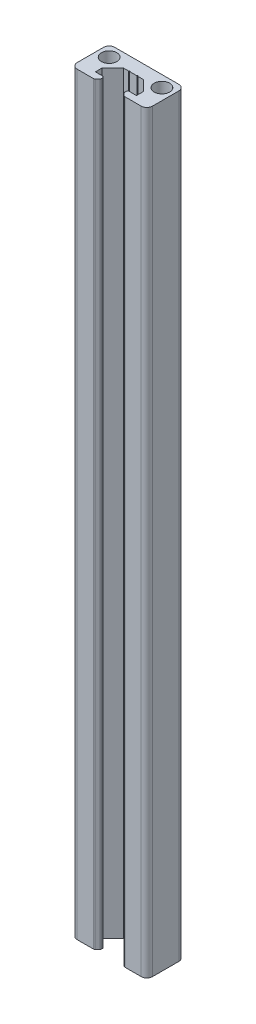
ISO-10303-21;
HEADER;
FILE_DESCRIPTION(('STEP AP214'),'2;1');
FILE_NAME('part.step','',(''),(''),'','','');
FILE_SCHEMA(('AUTOMOTIVE_DESIGN { 1 0 10303 214 1 1 1 1 }'));
ENDSEC;
DATA;
#1=APPLICATION_CONTEXT('core data for automotive mechanical design processes');
#2=APPLICATION_PROTOCOL_DEFINITION('international standard','automotive_design',2000,#1);
#3=PRODUCT_CONTEXT('',#1,'mechanical');
#4=PRODUCT('Part','Part','',(#3));
#5=PRODUCT_RELATED_PRODUCT_CATEGORY('part','',(#4));
#6=PRODUCT_DEFINITION_FORMATION('','',#4);
#7=PRODUCT_DEFINITION_CONTEXT('part definition',#1,'design');
#8=PRODUCT_DEFINITION('design','',#6,#7);
#9=PRODUCT_DEFINITION_SHAPE('','',#8);
#10=(LENGTH_UNIT() NAMED_UNIT(*) SI_UNIT(.MILLI.,.METRE.));
#11=(NAMED_UNIT(*) PLANE_ANGLE_UNIT() SI_UNIT($,.RADIAN.));
#12=(NAMED_UNIT(*) SI_UNIT($,.STERADIAN.) SOLID_ANGLE_UNIT());
#13=UNCERTAINTY_MEASURE_WITH_UNIT(LENGTH_MEASURE(1.E-05),#10,'distance_accuracy_value','');
#14=(GEOMETRIC_REPRESENTATION_CONTEXT(3) GLOBAL_UNCERTAINTY_ASSIGNED_CONTEXT((#13)) GLOBAL_UNIT_ASSIGNED_CONTEXT((#10,
#11,#12)) REPRESENTATION_CONTEXT('',''));
#15=CARTESIAN_POINT('',(0.,0.,0.));
#16=DIRECTION('',(0.,0.,1.));
#17=DIRECTION('',(1.,0.,0.));
#18=AXIS2_PLACEMENT_3D('',#15,#16,#17);
#19=CARTESIAN_POINT('',(-7.87459328292926,0.,-0.341605811527471));
#20=DIRECTION('',(0.,1.,0.));
#21=DIRECTION('',(1.,0.,0.));
#22=AXIS2_PLACEMENT_3D('',#19,#20,#21);
#23=PLANE('',#22);
#24=CARTESIAN_POINT('',(-0.874593282930221,0.,-2.34160581152736));
#25=DIRECTION('',(0.,-1.,0.));
#26=DIRECTION('',(-1.,0.,0.));
#27=AXIS2_PLACEMENT_3D('',#24,#25,#26);
#28=CIRCLE('',#27,2.05000000000013);
#29=CARTESIAN_POINT('',(1.1754067170699,0.,-2.34160581152736));
#30=VERTEX_POINT('',#29);
#31=EDGE_CURVE('E334',#30,#30,#28,.T.);
#32=ORIENTED_EDGE('',*,*,#31,.F.);
#33=EDGE_LOOP('',(#32));
#34=FACE_BOUND('',#33,.T.);
#35=CARTESIAN_POINT('',(-14.8745932829294,0.,-2.34160581152736));
#36=DIRECTION('',(0.,-1.,0.));
#37=DIRECTION('',(-1.,0.,0.));
#38=AXIS2_PLACEMENT_3D('',#35,#36,#37);
#39=CIRCLE('',#38,2.05000000000013);
#40=CARTESIAN_POINT('',(-12.8245932829293,0.,-2.34160581152736));
#41=VERTEX_POINT('',#40);
#42=EDGE_CURVE('E333',#41,#41,#39,.T.);
#43=ORIENTED_EDGE('',*,*,#42,.F.);
#44=EDGE_LOOP('',(#43));
#45=FACE_BOUND('',#44,.T.);
#46=CARTESIAN_POINT('',(-11.4745932829294,0.,3.55128740728645));
#47=DIRECTION('',(0.,1.,0.));
#48=DIRECTION('',(0.707106781186548,0.,0.707106781186547));
#49=AXIS2_PLACEMENT_3D('',#46,#47,#48);
#50=CIRCLE('',#49,0.499999999999924);
#51=CARTESIAN_POINT('',(-11.1210398923362,0.,3.90484079787967));
#52=VERTEX_POINT('',#51);
#53=CARTESIAN_POINT('',(-10.9745932829293,0.,3.55128740728645));
#54=VERTEX_POINT('',#53);
#55=EDGE_CURVE('E11',#52,#54,#50,.T.);
#56=ORIENTED_EDGE('',*,*,#55,.F.);
#57=DIRECTION('',(-0.707106781187044,0.,0.707106781186051));
#58=VECTOR('',#57,1.);
#59=CARTESIAN_POINT('',(-11.1210398923362,0.,3.90484079787967));
#60=LINE('',#59,#58);
#61=CARTESIAN_POINT('',(-11.7281466735233,0.,4.51194757906592));
#62=VERTEX_POINT('',#61);
#63=EDGE_CURVE('E468',#52,#62,#60,.T.);
#64=ORIENTED_EDGE('',*,*,#63,.T.);
#65=CARTESIAN_POINT('',(-12.0817000641165,0.,4.1583941884727));
#66=DIRECTION('',(0.,1.,0.));
#67=DIRECTION('',(0.,0.,1.));
#68=AXIS2_PLACEMENT_3D('',#65,#66,#67);
#69=CIRCLE('',#68,0.500000000000114);
#70=CARTESIAN_POINT('',(-12.0817000641165,0.,4.65839418847281));
#71=VERTEX_POINT('',#70);
#72=EDGE_CURVE('E524',#71,#62,#69,.T.);
#73=ORIENTED_EDGE('',*,*,#72,.F.);
#74=DIRECTION('',(-1.,0.,0.));
#75=VECTOR('',#74,1.);
#76=CARTESIAN_POINT('',(-12.0817000641165,0.,4.65839418847281));
#77=LINE('',#76,#75);
#78=CARTESIAN_POINT('',(-16.3745932829292,0.,4.65839418847253));
#79=VERTEX_POINT('',#78);
#80=EDGE_CURVE('E505',#71,#79,#77,.T.);
#81=ORIENTED_EDGE('',*,*,#80,.T.);
#82=CARTESIAN_POINT('',(-16.3745932829292,0.,3.15839418847247));
#83=DIRECTION('',(0.,1.,0.));
#84=DIRECTION('',(-1.,0.,0.));
#85=AXIS2_PLACEMENT_3D('',#82,#83,#84);
#86=CIRCLE('',#85,1.50000000000006);
#87=CARTESIAN_POINT('',(-17.8745932829293,0.,3.15839418847247));
#88=VERTEX_POINT('',#87);
#89=EDGE_CURVE('E393',#88,#79,#86,.T.);
#90=ORIENTED_EDGE('',*,*,#89,.F.);
#91=DIRECTION('',(0.,0.,1.));
#92=VECTOR('',#91,1.);
#93=CARTESIAN_POINT('',(-17.8745932829293,0.,-3.84160581152741));
#94=LINE('',#93,#92);
#95=CARTESIAN_POINT('',(-17.8745932829293,0.,-3.84160581152741));
#96=VERTEX_POINT('',#95);
#97=EDGE_CURVE('E450',#96,#88,#94,.T.);
#98=ORIENTED_EDGE('',*,*,#97,.F.);
#99=CARTESIAN_POINT('',(-16.3745932829292,0.,-3.84160581152741));
#100=DIRECTION('',(0.,1.,0.));
#101=DIRECTION('',(0.,0.,-1.));
#102=AXIS2_PLACEMENT_3D('',#99,#100,#101);
#103=CIRCLE('',#102,1.50000000000006);
#104=CARTESIAN_POINT('',(-16.3745932829292,0.,-5.34160581152747));
#105=VERTEX_POINT('',#104);
#106=EDGE_CURVE('E554',#105,#96,#103,.T.);
#107=ORIENTED_EDGE('',*,*,#106,.F.);
#108=DIRECTION('',(-1.,0.,0.));
#109=VECTOR('',#108,1.);
#110=CARTESIAN_POINT('',(0.625406717070688,0.,-5.34160581152747));
#111=LINE('',#110,#109);
#112=CARTESIAN_POINT('',(0.625406717070688,0.,-5.34160581152747));
#113=VERTEX_POINT('',#112);
#114=EDGE_CURVE('E516',#113,#105,#111,.T.);
#115=ORIENTED_EDGE('',*,*,#114,.F.);
#116=CARTESIAN_POINT('',(0.625406717070688,0.,-3.84160581152742));
#117=DIRECTION('',(0.,1.,0.));
#118=DIRECTION('',(1.,0.,0.));
#119=AXIS2_PLACEMENT_3D('',#116,#117,#118);
#120=CIRCLE('',#119,1.50000000000006);
#121=CARTESIAN_POINT('',(2.12540671707074,0.,-3.84160581152742));
#122=VERTEX_POINT('',#121);
#123=EDGE_CURVE('E512',#122,#113,#120,.T.);
#124=ORIENTED_EDGE('',*,*,#123,.F.);
#125=DIRECTION('',(0.,0.,-1.));
#126=VECTOR('',#125,1.);
#127=CARTESIAN_POINT('',(2.12540671707075,0.,3.15839418847247));
#128=LINE('',#127,#126);
#129=CARTESIAN_POINT('',(2.12540671707075,0.,3.15839418847247));
#130=VERTEX_POINT('',#129);
#131=EDGE_CURVE('E427',#130,#122,#128,.T.);
#132=ORIENTED_EDGE('',*,*,#131,.F.);
#133=CARTESIAN_POINT('',(0.625406717070689,0.,3.15839418847247));
#134=DIRECTION('',(0.,1.,0.));
#135=DIRECTION('',(0.,0.,1.));
#136=AXIS2_PLACEMENT_3D('',#133,#134,#135);
#137=CIRCLE('',#136,1.50000000000006);
#138=CARTESIAN_POINT('',(0.625406717070689,0.,4.65839418847253));
#139=VERTEX_POINT('',#138);
#140=EDGE_CURVE('E578',#139,#130,#137,.T.);
#141=ORIENTED_EDGE('',*,*,#140,.F.);
#142=DIRECTION('',(1.,0.,0.));
#143=VECTOR('',#142,1.);
#144=CARTESIAN_POINT('',(-3.66748650174344,0.,4.65839418847253));
#145=LINE('',#144,#143);
#146=CARTESIAN_POINT('',(-3.66748650174344,0.,4.65839418847281));
#147=VERTEX_POINT('',#146);
#148=EDGE_CURVE('E379',#147,#139,#145,.T.);
#149=ORIENTED_EDGE('',*,*,#148,.F.);
#150=CARTESIAN_POINT('',(-3.66748650174344,0.,4.1583941884727));
#151=DIRECTION('',(0.,1.,0.));
#152=DIRECTION('',(-0.707106781186547,0.,0.707106781186548));
#153=AXIS2_PLACEMENT_3D('',#150,#151,#152);
#154=CIRCLE('',#153,0.499999999999924);
#155=CARTESIAN_POINT('',(-4.02103989233666,0.,4.51194757906592));
#156=VERTEX_POINT('',#155);
#157=EDGE_CURVE('E371',#156,#147,#154,.T.);
#158=ORIENTED_EDGE('',*,*,#157,.F.);
#159=DIRECTION('',(0.707106781186879,0.,0.707106781186216));
#160=VECTOR('',#159,1.);
#161=CARTESIAN_POINT('',(-4.62814667352348,0.,3.90484079787967));
#162=LINE('',#161,#160);
#163=CARTESIAN_POINT('',(-4.62814667352348,0.,3.90484079787967));
#164=VERTEX_POINT('',#163);
#165=EDGE_CURVE('E384',#164,#156,#162,.T.);
#166=ORIENTED_EDGE('',*,*,#165,.F.);
#167=CARTESIAN_POINT('',(-4.27459328293026,0.,3.55128740728645));
#168=DIRECTION('',(0.,1.,0.));
#169=DIRECTION('',(-1.,0.,0.));
#170=AXIS2_PLACEMENT_3D('',#167,#168,#169);
#171=CIRCLE('',#170,0.500000000000114);
#172=CARTESIAN_POINT('',(-4.77459328293037,0.,3.55128740728645));
#173=VERTEX_POINT('',#172);
#174=EDGE_CURVE('E408',#173,#164,#171,.T.);
#175=ORIENTED_EDGE('',*,*,#174,.F.);
#176=DIRECTION('',(0.,0.,-1.));
#177=VECTOR('',#176,1.);
#178=CARTESIAN_POINT('',(-4.77459328293037,0.,3.55128740728645));
#179=LINE('',#178,#177);
#180=CARTESIAN_POINT('',(-4.77459328293037,0.,3.35839418847144));
#181=VERTEX_POINT('',#180);
#182=EDGE_CURVE('E433',#173,#181,#179,.T.);
#183=ORIENTED_EDGE('',*,*,#182,.T.);
#184=CARTESIAN_POINT('',(-4.27459328293026,0.,3.35839418847144));
#185=DIRECTION('',(0.,1.,0.));
#186=DIRECTION('',(5.68311723928036E-13,0.,-1.));
#187=AXIS2_PLACEMENT_3D('',#184,#185,#186);
#188=CIRCLE('',#187,0.500000000000114);
#189=CARTESIAN_POINT('',(-4.27459328292997,0.,2.85839418847132));
#190=VERTEX_POINT('',#189);
#191=EDGE_CURVE('E403',#190,#181,#188,.T.);
#192=ORIENTED_EDGE('',*,*,#191,.F.);
#193=DIRECTION('',(-1.,0.,-7.68031844249678E-13));
#194=VECTOR('',#193,1.);
#195=CARTESIAN_POINT('',(-2.42459328292938,0.,2.85839418847274));
#196=LINE('',#195,#194);
#197=CARTESIAN_POINT('',(-2.42459328292938,0.,2.85839418847274));
#198=VERTEX_POINT('',#197);
#199=EDGE_CURVE('E339',#198,#190,#196,.T.);
#200=ORIENTED_EDGE('',*,*,#199,.F.);
#201=DIRECTION('',(0.,0.,-1.));
#202=VECTOR('',#201,1.);
#203=CARTESIAN_POINT('',(-2.42459328292938,0.,2.85839418847274));
#204=LINE('',#203,#202);
#205=CARTESIAN_POINT('',(-2.42459328292938,0.,1.05839418847268));
#206=VERTEX_POINT('',#205);
#207=EDGE_CURVE('E349',#198,#206,#204,.T.);
#208=ORIENTED_EDGE('',*,*,#207,.T.);
#209=DIRECTION('',(0.707106781186548,0.,0.707106781186547));
#210=VECTOR('',#209,1.);
#211=CARTESIAN_POINT('',(-5.22459328292939,0.,-1.74160581152733));
#212=LINE('',#211,#210);
#213=CARTESIAN_POINT('',(-5.22459328292939,0.,-1.74160581152733));
#214=VERTEX_POINT('',#213);
#215=EDGE_CURVE('E323',#214,#206,#212,.T.);
#216=ORIENTED_EDGE('',*,*,#215,.F.);
#217=DIRECTION('',(-1.,0.,0.));
#218=VECTOR('',#217,1.);
#219=CARTESIAN_POINT('',(-5.22459328292939,0.,-1.74160581152733));
#220=LINE('',#219,#218);
#221=CARTESIAN_POINT('',(-6.62459328292954,0.,-1.74160581152733));
#222=VERTEX_POINT('',#221);
#223=EDGE_CURVE('E515',#214,#222,#220,.T.);
#224=ORIENTED_EDGE('',*,*,#223,.T.);
#225=CARTESIAN_POINT('',(-6.7745932829294,0.,-1.74160581152733));
#226=DIRECTION('',(0.,1.,0.));
#227=DIRECTION('',(1.,0.,0.));
#228=AXIS2_PLACEMENT_3D('',#225,#226,#227);
#229=CIRCLE('',#228,0.149999999999864);
#230=CARTESIAN_POINT('',(-6.92459328292927,0.,-1.74160581152733));
#231=VERTEX_POINT('',#230);
#232=EDGE_CURVE('E307',#222,#231,#229,.T.);
#233=ORIENTED_EDGE('',*,*,#232,.T.);
#234=DIRECTION('',(-1.,0.,0.));
#235=VECTOR('',#234,1.);
#236=CARTESIAN_POINT('',(-6.92459328292927,0.,-1.74160581152733));
#237=LINE('',#236,#235);
#238=CARTESIAN_POINT('',(-8.82459328292953,0.,-1.74160581152733));
#239=VERTEX_POINT('',#238);
#240=EDGE_CURVE('E305',#231,#239,#237,.T.);
#241=ORIENTED_EDGE('',*,*,#240,.T.);
#242=CARTESIAN_POINT('',(-8.97459328292939,0.,-1.74160581152733));
#243=DIRECTION('',(0.,1.,0.));
#244=DIRECTION('',(1.,0.,0.));
#245=AXIS2_PLACEMENT_3D('',#242,#243,#244);
#246=CIRCLE('',#245,0.149999999999864);
#247=CARTESIAN_POINT('',(-9.12459328292926,0.,-1.74160581152733));
#248=VERTEX_POINT('',#247);
#249=EDGE_CURVE('E291',#239,#248,#246,.T.);
#250=ORIENTED_EDGE('',*,*,#249,.T.);
#251=DIRECTION('',(-1.,0.,0.));
#252=VECTOR('',#251,1.);
#253=CARTESIAN_POINT('',(-9.12459328292926,0.,-1.74160581152733));
#254=LINE('',#253,#252);
#255=CARTESIAN_POINT('',(-10.5245932829294,0.,-1.74160581152733));
#256=VERTEX_POINT('',#255);
#257=EDGE_CURVE('E388',#248,#256,#254,.T.);
#258=ORIENTED_EDGE('',*,*,#257,.T.);
#259=DIRECTION('',(-0.707106781186547,0.,0.707106781186548));
#260=VECTOR('',#259,1.);
#261=CARTESIAN_POINT('',(-10.5245932829294,0.,-1.74160581152733));
#262=LINE('',#261,#260);
#263=CARTESIAN_POINT('',(-13.3245932829294,0.,1.05839418847268));
#264=VERTEX_POINT('',#263);
#265=EDGE_CURVE('E360',#256,#264,#262,.T.);
#266=ORIENTED_EDGE('',*,*,#265,.T.);
#267=DIRECTION('',(0.,0.,-1.));
#268=VECTOR('',#267,1.);
#269=CARTESIAN_POINT('',(-13.3245932829294,0.,2.85839418847275));
#270=LINE('',#269,#268);
#271=CARTESIAN_POINT('',(-13.3245932829294,0.,2.85839418847275));
#272=VERTEX_POINT('',#271);
#273=EDGE_CURVE('E443',#272,#264,#270,.T.);
#274=ORIENTED_EDGE('',*,*,#273,.F.);
#275=DIRECTION('',(1.,0.,-6.14645911824061E-13));
#276=VECTOR('',#275,1.);
#277=CARTESIAN_POINT('',(-13.3245932829294,0.,2.85839418847275));
#278=LINE('',#277,#276);
#279=CARTESIAN_POINT('',(-11.4745932829302,0.,2.85839418847132));
#280=VERTEX_POINT('',#279);
#281=EDGE_CURVE('E370',#272,#280,#278,.T.);
#282=ORIENTED_EDGE('',*,*,#281,.T.);
#283=CARTESIAN_POINT('',(-11.4745932829294,0.,3.35839418847144));
#284=DIRECTION('',(0.,1.,0.));
#285=DIRECTION('',(1.,0.,0.));
#286=AXIS2_PLACEMENT_3D('',#283,#284,#285);
#287=CIRCLE('',#286,0.500000000000114);
#288=CARTESIAN_POINT('',(-10.9745932829293,0.,3.35839418847144));
#289=VERTEX_POINT('',#288);
#290=EDGE_CURVE('E369',#289,#280,#287,.T.);
#291=ORIENTED_EDGE('',*,*,#290,.F.);
#292=DIRECTION('',(0.,0.,-1.));
#293=VECTOR('',#292,1.);
#294=CARTESIAN_POINT('',(-10.9745932829296,0.,3.55128740728645));
#295=LINE('',#294,#293);
#296=EDGE_CURVE('E28',#54,#289,#295,.T.);
#297=ORIENTED_EDGE('',*,*,#296,.F.);
#298=EDGE_LOOP('',(#56,#64,#73,#81,#90,#98,#107,#115,#124,#132,#141,#149,#158,#166,#175,#183,
#192,#200,#208,#216,#224,#233,#241,#250,#258,#266,#274,#282,#291,#297));
#299=FACE_BOUND('',#298,.T.);
#300=ADVANCED_FACE('F17',(#34,#45,#299),#23,.F.);
#301=CARTESIAN_POINT('',(-11.4745932829294,0.,3.55128740728645));
#302=DIRECTION('',(0.,1.,0.));
#303=DIRECTION('',(0.707106781186548,0.,0.707106781186547));
#304=AXIS2_PLACEMENT_3D('',#301,#302,#303);
#305=CYLINDRICAL_SURFACE('',#304,0.499999999999924);
#306=DIRECTION('',(0.,1.,0.));
#307=VECTOR('',#306,1.);
#308=CARTESIAN_POINT('',(-11.1210398923362,0.,3.90484079787967));
#309=LINE('',#308,#307);
#310=CARTESIAN_POINT('',(-11.1210398923362,200.,3.90484079787967));
#311=VERTEX_POINT('',#310);
#312=EDGE_CURVE('E565',#52,#311,#309,.T.);
#313=ORIENTED_EDGE('',*,*,#312,.F.);
#314=ORIENTED_EDGE('',*,*,#55,.T.);
#315=DIRECTION('',(0.,1.,0.));
#316=VECTOR('',#315,1.);
#317=CARTESIAN_POINT('',(-10.9745932829293,0.,3.55128740728645));
#318=LINE('',#317,#316);
#319=CARTESIAN_POINT('',(-10.9745932829293,200.,3.55128740728645));
#320=VERTEX_POINT('',#319);
#321=EDGE_CURVE('E557',#54,#320,#318,.T.);
#322=ORIENTED_EDGE('',*,*,#321,.T.);
#323=CARTESIAN_POINT('',(-11.4745932829294,200.,3.55128740728645));
#324=DIRECTION('',(0.,1.,0.));
#325=DIRECTION('',(0.707106781186548,0.,0.707106781186547));
#326=AXIS2_PLACEMENT_3D('',#323,#324,#325);
#327=CIRCLE('',#326,0.499999999999924);
#328=EDGE_CURVE('E456',#311,#320,#327,.T.);
#329=ORIENTED_EDGE('',*,*,#328,.F.);
#330=EDGE_LOOP('',(#313,#314,#322,#329));
#331=FACE_BOUND('',#330,.T.);
#332=ADVANCED_FACE('F721',(#331),#305,.T.);
#333=CARTESIAN_POINT('',(-10.9745932829296,0.,3.55128740728645));
#334=DIRECTION('',(1.,0.,0.));
#335=DIRECTION('',(0.,0.,-1.));
#336=AXIS2_PLACEMENT_3D('',#333,#334,#335);
#337=PLANE('',#336);
#338=ORIENTED_EDGE('',*,*,#321,.F.);
#339=ORIENTED_EDGE('',*,*,#296,.T.);
#340=DIRECTION('',(0.,1.,0.));
#341=VECTOR('',#340,1.);
#342=CARTESIAN_POINT('',(-10.9745932829293,0.,3.35839418847144));
#343=LINE('',#342,#341);
#344=CARTESIAN_POINT('',(-10.9745932829293,200.,3.35839418847144));
#345=VERTEX_POINT('',#344);
#346=EDGE_CURVE('E366',#289,#345,#343,.T.);
#347=ORIENTED_EDGE('',*,*,#346,.T.);
#348=DIRECTION('',(0.,0.,-1.));
#349=VECTOR('',#348,1.);
#350=CARTESIAN_POINT('',(-10.9745932829296,200.,3.55128740728645));
#351=LINE('',#350,#349);
#352=EDGE_CURVE('E459',#320,#345,#351,.T.);
#353=ORIENTED_EDGE('',*,*,#352,.F.);
#354=EDGE_LOOP('',(#338,#339,#347,#353));
#355=FACE_BOUND('',#354,.T.);
#356=ADVANCED_FACE('F698',(#355),#337,.T.);
#357=CARTESIAN_POINT('',(-11.4745932829294,0.,3.35839418847144));
#358=DIRECTION('',(0.,1.,0.));
#359=DIRECTION('',(1.,0.,0.));
#360=AXIS2_PLACEMENT_3D('',#357,#358,#359);
#361=CYLINDRICAL_SURFACE('',#360,0.500000000000114);
#362=ORIENTED_EDGE('',*,*,#346,.F.);
#363=ORIENTED_EDGE('',*,*,#290,.T.);
#364=DIRECTION('',(0.,1.,0.));
#365=VECTOR('',#364,1.);
#366=CARTESIAN_POINT('',(-11.4745932829302,0.,2.85839418847132));
#367=LINE('',#366,#365);
#368=CARTESIAN_POINT('',(-11.4745932829302,200.,2.85839418847132));
#369=VERTEX_POINT('',#368);
#370=EDGE_CURVE('E446',#280,#369,#367,.T.);
#371=ORIENTED_EDGE('',*,*,#370,.T.);
#372=CARTESIAN_POINT('',(-11.4745932829294,200.,3.35839418847144));
#373=DIRECTION('',(0.,1.,0.));
#374=DIRECTION('',(1.,0.,0.));
#375=AXIS2_PLACEMENT_3D('',#372,#373,#374);
#376=CIRCLE('',#375,0.500000000000114);
#377=EDGE_CURVE('E498',#345,#369,#376,.T.);
#378=ORIENTED_EDGE('',*,*,#377,.F.);
#379=EDGE_LOOP('',(#362,#363,#371,#378));
#380=FACE_BOUND('',#379,.T.);
#381=ADVANCED_FACE('F692',(#380),#361,.T.);
#382=CARTESIAN_POINT('',(-11.4745932829302,0.,2.85839418847161));
#383=DIRECTION('',(-6.14645911824061E-13,0.,-1.));
#384=DIRECTION('',(-1.,0.,6.14645911824061E-13));
#385=AXIS2_PLACEMENT_3D('',#382,#383,#384);
#386=PLANE('',#385);
#387=ORIENTED_EDGE('',*,*,#370,.F.);
#388=ORIENTED_EDGE('',*,*,#281,.F.);
#389=DIRECTION('',(0.,1.,0.));
#390=VECTOR('',#389,1.);
#391=CARTESIAN_POINT('',(-13.3245932829294,0.,2.85839418847275));
#392=LINE('',#391,#390);
#393=CARTESIAN_POINT('',(-13.3245932829294,200.,2.85839418847275));
#394=VERTEX_POINT('',#393);
#395=EDGE_CURVE('E364',#272,#394,#392,.T.);
#396=ORIENTED_EDGE('',*,*,#395,.T.);
#397=DIRECTION('',(-1.,0.,6.14645911824061E-13));
#398=VECTOR('',#397,1.);
#399=CARTESIAN_POINT('',(-13.3245932829294,200.,2.85839418847275));
#400=LINE('',#399,#398);
#401=EDGE_CURVE('E575',#369,#394,#400,.T.);
#402=ORIENTED_EDGE('',*,*,#401,.F.);
#403=EDGE_LOOP('',(#387,#388,#396,#402));
#404=FACE_BOUND('',#403,.T.);
#405=ADVANCED_FACE('F697',(#404),#386,.T.);
#406=CARTESIAN_POINT('',(-13.3245932829294,0.,2.85839418847275));
#407=DIRECTION('',(1.,0.,0.));
#408=DIRECTION('',(0.,0.,-1.));
#409=AXIS2_PLACEMENT_3D('',#406,#407,#408);
#410=PLANE('',#409);
#411=ORIENTED_EDGE('',*,*,#395,.F.);
#412=ORIENTED_EDGE('',*,*,#273,.T.);
#413=DIRECTION('',(0.,1.,0.));
#414=VECTOR('',#413,1.);
#415=CARTESIAN_POINT('',(-13.3245932829294,0.,1.05839418847268));
#416=LINE('',#415,#414);
#417=CARTESIAN_POINT('',(-13.3245932829294,200.,1.05839418847268));
#418=VERTEX_POINT('',#417);
#419=EDGE_CURVE('E365',#264,#418,#416,.T.);
#420=ORIENTED_EDGE('',*,*,#419,.T.);
#421=DIRECTION('',(0.,0.,-1.));
#422=VECTOR('',#421,1.);
#423=CARTESIAN_POINT('',(-13.3245932829294,200.,2.85839418847275));
#424=LINE('',#423,#422);
#425=EDGE_CURVE('E501',#394,#418,#424,.T.);
#426=ORIENTED_EDGE('',*,*,#425,.F.);
#427=EDGE_LOOP('',(#411,#412,#420,#426));
#428=FACE_BOUND('',#427,.T.);
#429=ADVANCED_FACE('F760',(#428),#410,.T.);
#430=CARTESIAN_POINT('',(-13.3245932829294,0.,1.05839418847268));
#431=DIRECTION('',(0.707106781186548,0.,0.707106781186547));
#432=DIRECTION('',(0.,-1.,0.));
#433=AXIS2_PLACEMENT_3D('',#430,#431,#432);
#434=PLANE('',#433);
#435=ORIENTED_EDGE('',*,*,#419,.F.);
#436=ORIENTED_EDGE('',*,*,#265,.F.);
#437=DIRECTION('',(0.,1.,0.));
#438=VECTOR('',#437,1.);
#439=CARTESIAN_POINT('',(-10.5245932829294,0.,-1.74160581152733));
#440=LINE('',#439,#438);
#441=CARTESIAN_POINT('',(-10.5245932829294,200.,-1.74160581152733));
#442=VERTEX_POINT('',#441);
#443=EDGE_CURVE('E392',#256,#442,#440,.T.);
#444=ORIENTED_EDGE('',*,*,#443,.T.);
#445=DIRECTION('',(0.707106781186547,0.,-0.707106781186548));
#446=VECTOR('',#445,1.);
#447=CARTESIAN_POINT('',(-10.5245932829294,200.,-1.74160581152733));
#448=LINE('',#447,#446);
#449=EDGE_CURVE('E486',#418,#442,#448,.T.);
#450=ORIENTED_EDGE('',*,*,#449,.F.);
#451=EDGE_LOOP('',(#435,#436,#444,#450));
#452=FACE_BOUND('',#451,.T.);
#453=ADVANCED_FACE('F889',(#452),#434,.T.);
#454=CARTESIAN_POINT('',(-6.62459328292954,0.,-1.74160581152733));
#455=DIRECTION('',(0.,0.,1.));
#456=DIRECTION('',(1.,0.,0.));
#457=AXIS2_PLACEMENT_3D('',#454,#455,#456);
#458=PLANE('',#457);
#459=DIRECTION('',(0.,1.,0.));
#460=VECTOR('',#459,1.);
#461=CARTESIAN_POINT('',(-6.62459328292954,0.,-1.74160581152733));
#462=LINE('',#461,#460);
#463=CARTESIAN_POINT('',(-6.62459328292954,200.,-1.74160581152733));
#464=VERTEX_POINT('',#463);
#465=EDGE_CURVE('E419',#222,#464,#462,.T.);
#466=ORIENTED_EDGE('',*,*,#465,.F.);
#467=ORIENTED_EDGE('',*,*,#223,.F.);
#468=DIRECTION('',(0.,1.,0.));
#469=VECTOR('',#468,1.);
#470=CARTESIAN_POINT('',(-5.22459328292939,0.,-1.74160581152733));
#471=LINE('',#470,#469);
#472=CARTESIAN_POINT('',(-5.22459328292939,200.,-1.74160581152733));
#473=VERTEX_POINT('',#472);
#474=EDGE_CURVE('E418',#214,#473,#471,.T.);
#475=ORIENTED_EDGE('',*,*,#474,.T.);
#476=DIRECTION('',(1.,0.,0.));
#477=VECTOR('',#476,1.);
#478=CARTESIAN_POINT('',(-5.22459328292939,200.,-1.74160581152733));
#479=LINE('',#478,#477);
#480=EDGE_CURVE('E482',#464,#473,#479,.T.);
#481=ORIENTED_EDGE('',*,*,#480,.F.);
#482=EDGE_LOOP('',(#466,#467,#475,#481));
#483=FACE_BOUND('',#482,.T.);
#484=ADVANCED_FACE('F807',(#483),#458,.T.);
#485=CARTESIAN_POINT('',(0.625406717070688,0.,-3.84160581152742));
#486=DIRECTION('',(0.,1.,0.));
#487=DIRECTION('',(1.,0.,0.));
#488=AXIS2_PLACEMENT_3D('',#485,#486,#487);
#489=CYLINDRICAL_SURFACE('',#488,1.50000000000006);
#490=DIRECTION('',(0.,1.,0.));
#491=VECTOR('',#490,1.);
#492=CARTESIAN_POINT('',(2.12540671707074,0.,-3.84160581152742));
#493=LINE('',#492,#491);
#494=CARTESIAN_POINT('',(2.12540671707074,200.,-3.84160581152742));
#495=VERTEX_POINT('',#494);
#496=EDGE_CURVE('E431',#122,#495,#493,.T.);
#497=ORIENTED_EDGE('',*,*,#496,.F.);
#498=ORIENTED_EDGE('',*,*,#123,.T.);
#499=DIRECTION('',(0.,1.,0.));
#500=VECTOR('',#499,1.);
#501=CARTESIAN_POINT('',(0.625406717070688,0.,-5.34160581152747));
#502=LINE('',#501,#500);
#503=CARTESIAN_POINT('',(0.625406717070687,200.,-5.34160581152747));
#504=VERTEX_POINT('',#503);
#505=EDGE_CURVE('E21',#113,#504,#502,.T.);
#506=ORIENTED_EDGE('',*,*,#505,.T.);
#507=CARTESIAN_POINT('',(0.625406717070688,200.,-3.84160581152742));
#508=DIRECTION('',(0.,1.,0.));
#509=DIRECTION('',(1.,0.,0.));
#510=AXIS2_PLACEMENT_3D('',#507,#508,#509);
#511=CIRCLE('',#510,1.50000000000006);
#512=EDGE_CURVE('E485',#495,#504,#511,.T.);
#513=ORIENTED_EDGE('',*,*,#512,.F.);
#514=EDGE_LOOP('',(#497,#498,#506,#513));
#515=FACE_BOUND('',#514,.T.);
#516=ADVANCED_FACE('F656',(#515),#489,.T.);
#517=CARTESIAN_POINT('',(0.625406717070688,0.,-5.34160581152747));
#518=DIRECTION('',(0.,0.,-1.));
#519=DIRECTION('',(-1.,0.,0.));
#520=AXIS2_PLACEMENT_3D('',#517,#518,#519);
#521=PLANE('',#520);
#522=ORIENTED_EDGE('',*,*,#505,.F.);
#523=ORIENTED_EDGE('',*,*,#114,.T.);
#524=DIRECTION('',(0.,1.,0.));
#525=VECTOR('',#524,1.);
#526=CARTESIAN_POINT('',(-16.3745932829292,0.,-5.34160581152747));
#527=LINE('',#526,#525);
#528=CARTESIAN_POINT('',(-16.3745932829292,200.,-5.34160581152747));
#529=VERTEX_POINT('',#528);
#530=EDGE_CURVE('E453',#105,#529,#527,.T.);
#531=ORIENTED_EDGE('',*,*,#530,.T.);
#532=DIRECTION('',(-1.,0.,0.));
#533=VECTOR('',#532,1.);
#534=CARTESIAN_POINT('',(0.625406717070688,200.,-5.34160581152747));
#535=LINE('',#534,#533);
#536=EDGE_CURVE('E359',#504,#529,#535,.T.);
#537=ORIENTED_EDGE('',*,*,#536,.F.);
#538=EDGE_LOOP('',(#522,#523,#531,#537));
#539=FACE_BOUND('',#538,.T.);
#540=ADVANCED_FACE('F739',(#539),#521,.T.);
#541=CARTESIAN_POINT('',(-16.3745932829292,0.,-3.84160581152741));
#542=DIRECTION('',(0.,1.,0.));
#543=DIRECTION('',(0.,0.,-1.));
#544=AXIS2_PLACEMENT_3D('',#541,#542,#543);
#545=CYLINDRICAL_SURFACE('',#544,1.50000000000006);
#546=ORIENTED_EDGE('',*,*,#530,.F.);
#547=ORIENTED_EDGE('',*,*,#106,.T.);
#548=DIRECTION('',(0.,1.,0.));
#549=VECTOR('',#548,1.);
#550=CARTESIAN_POINT('',(-17.8745932829293,0.,-3.84160581152741));
#551=LINE('',#550,#549);
#552=CARTESIAN_POINT('',(-17.8745932829293,200.,-3.84160581152741));
#553=VERTEX_POINT('',#552);
#554=EDGE_CURVE('E396',#96,#553,#551,.T.);
#555=ORIENTED_EDGE('',*,*,#554,.T.);
#556=CARTESIAN_POINT('',(-16.3745932829292,200.,-3.84160581152741));
#557=DIRECTION('',(0.,1.,0.));
#558=DIRECTION('',(0.,0.,-1.));
#559=AXIS2_PLACEMENT_3D('',#556,#557,#558);
#560=CIRCLE('',#559,1.50000000000006);
#561=EDGE_CURVE('E354',#529,#553,#560,.T.);
#562=ORIENTED_EDGE('',*,*,#561,.F.);
#563=EDGE_LOOP('',(#546,#547,#555,#562));
#564=FACE_BOUND('',#563,.T.);
#565=ADVANCED_FACE('F730',(#564),#545,.T.);
#566=CARTESIAN_POINT('',(-17.8745932829293,0.,-3.84160581152741));
#567=DIRECTION('',(-1.,0.,0.));
#568=DIRECTION('',(0.,1.,0.));
#569=AXIS2_PLACEMENT_3D('',#566,#567,#568);
#570=PLANE('',#569);
#571=ORIENTED_EDGE('',*,*,#554,.F.);
#572=ORIENTED_EDGE('',*,*,#97,.T.);
#573=DIRECTION('',(0.,1.,0.));
#574=VECTOR('',#573,1.);
#575=CARTESIAN_POINT('',(-17.8745932829293,0.,3.15839418847247));
#576=LINE('',#575,#574);
#577=CARTESIAN_POINT('',(-17.8745932829293,200.,3.15839418847247));
#578=VERTEX_POINT('',#577);
#579=EDGE_CURVE('E397',#88,#578,#576,.T.);
#580=ORIENTED_EDGE('',*,*,#579,.T.);
#581=DIRECTION('',(0.,0.,1.));
#582=VECTOR('',#581,1.);
#583=CARTESIAN_POINT('',(-17.8745932829293,200.,-3.84160581152741));
#584=LINE('',#583,#582);
#585=EDGE_CURVE('E358',#553,#578,#584,.T.);
#586=ORIENTED_EDGE('',*,*,#585,.F.);
#587=EDGE_LOOP('',(#571,#572,#580,#586));
#588=FACE_BOUND('',#587,.T.);
#589=ADVANCED_FACE('F711',(#588),#570,.T.);
#590=CARTESIAN_POINT('',(-16.3745932829292,0.,3.15839418847247));
#591=DIRECTION('',(0.,1.,0.));
#592=DIRECTION('',(-1.,0.,0.));
#593=AXIS2_PLACEMENT_3D('',#590,#591,#592);
#594=CYLINDRICAL_SURFACE('',#593,1.50000000000006);
#595=ORIENTED_EDGE('',*,*,#579,.F.);
#596=ORIENTED_EDGE('',*,*,#89,.T.);
#597=DIRECTION('',(0.,1.,0.));
#598=VECTOR('',#597,1.);
#599=CARTESIAN_POINT('',(-16.3745932829292,0.,4.65839418847253));
#600=LINE('',#599,#598);
#601=CARTESIAN_POINT('',(-16.3745932829292,200.,4.65839418847253));
#602=VERTEX_POINT('',#601);
#603=EDGE_CURVE('E509',#79,#602,#600,.T.);
#604=ORIENTED_EDGE('',*,*,#603,.T.);
#605=CARTESIAN_POINT('',(-16.3745932829292,200.,3.15839418847247));
#606=DIRECTION('',(0.,1.,0.));
#607=DIRECTION('',(-1.,0.,0.));
#608=AXIS2_PLACEMENT_3D('',#605,#606,#607);
#609=CIRCLE('',#608,1.50000000000006);
#610=EDGE_CURVE('E345',#578,#602,#609,.T.);
#611=ORIENTED_EDGE('',*,*,#610,.F.);
#612=EDGE_LOOP('',(#595,#596,#604,#611));
#613=FACE_BOUND('',#612,.T.);
#614=ADVANCED_FACE('F705',(#613),#594,.T.);
#615=CARTESIAN_POINT('',(-16.3745932829292,0.,4.65839418847253));
#616=DIRECTION('',(0.,0.,1.));
#617=DIRECTION('',(1.,0.,0.));
#618=AXIS2_PLACEMENT_3D('',#615,#616,#617);
#619=PLANE('',#618);
#620=ORIENTED_EDGE('',*,*,#603,.F.);
#621=ORIENTED_EDGE('',*,*,#80,.F.);
#622=DIRECTION('',(0.,1.,0.));
#623=VECTOR('',#622,1.);
#624=CARTESIAN_POINT('',(-12.0817000641165,0.,4.65839418847281));
#625=LINE('',#624,#623);
#626=CARTESIAN_POINT('',(-12.0817000641165,200.,4.65839418847281));
#627=VERTEX_POINT('',#626);
#628=EDGE_CURVE('E568',#71,#627,#625,.T.);
#629=ORIENTED_EDGE('',*,*,#628,.T.);
#630=DIRECTION('',(1.,0.,0.));
#631=VECTOR('',#630,1.);
#632=CARTESIAN_POINT('',(-12.0817000641165,200.,4.65839418847281));
#633=LINE('',#632,#631);
#634=EDGE_CURVE('E340',#602,#627,#633,.T.);
#635=ORIENTED_EDGE('',*,*,#634,.F.);
#636=EDGE_LOOP('',(#620,#621,#629,#635));
#637=FACE_BOUND('',#636,.T.);
#638=ADVANCED_FACE('F710',(#637),#619,.T.);
#639=CARTESIAN_POINT('',(-12.0817000641165,0.,4.1583941884727));
#640=DIRECTION('',(0.,1.,0.));
#641=DIRECTION('',(0.,0.,1.));
#642=AXIS2_PLACEMENT_3D('',#639,#640,#641);
#643=CYLINDRICAL_SURFACE('',#642,0.500000000000114);
#644=ORIENTED_EDGE('',*,*,#628,.F.);
#645=ORIENTED_EDGE('',*,*,#72,.T.);
#646=DIRECTION('',(0.,1.,0.));
#647=VECTOR('',#646,1.);
#648=CARTESIAN_POINT('',(-11.7281466735233,0.,4.51194757906592));
#649=LINE('',#648,#647);
#650=CARTESIAN_POINT('',(-11.7281466735233,200.,4.51194757906592));
#651=VERTEX_POINT('',#650);
#652=EDGE_CURVE('E465',#62,#651,#649,.T.);
#653=ORIENTED_EDGE('',*,*,#652,.T.);
#654=CARTESIAN_POINT('',(-12.0817000641165,200.,4.1583941884727));
#655=DIRECTION('',(0.,1.,0.));
#656=DIRECTION('',(0.,0.,1.));
#657=AXIS2_PLACEMENT_3D('',#654,#655,#656);
#658=CIRCLE('',#657,0.500000000000114);
#659=EDGE_CURVE('E344',#627,#651,#658,.T.);
#660=ORIENTED_EDGE('',*,*,#659,.F.);
#661=EDGE_LOOP('',(#644,#645,#653,#660));
#662=FACE_BOUND('',#661,.T.);
#663=ADVANCED_FACE('F19',(#662),#643,.T.);
#664=CARTESIAN_POINT('',(-11.7281466735233,0.,4.51194757906592));
#665=DIRECTION('',(0.707106781186051,0.,0.707106781187044));
#666=DIRECTION('',(0.,-1.,0.));
#667=AXIS2_PLACEMENT_3D('',#664,#665,#666);
#668=PLANE('',#667);
#669=ORIENTED_EDGE('',*,*,#652,.F.);
#670=ORIENTED_EDGE('',*,*,#63,.F.);
#671=ORIENTED_EDGE('',*,*,#312,.T.);
#672=DIRECTION('',(0.707106781187044,0.,-0.707106781186051));
#673=VECTOR('',#672,1.);
#674=CARTESIAN_POINT('',(-11.1210398923362,200.,3.90484079787967));
#675=LINE('',#674,#673);
#676=EDGE_CURVE('E469',#651,#311,#675,.T.);
#677=ORIENTED_EDGE('',*,*,#676,.F.);
#678=EDGE_LOOP('',(#669,#670,#671,#677));
#679=FACE_BOUND('',#678,.T.);
#680=ADVANCED_FACE('F745',(#679),#668,.T.);
#681=CARTESIAN_POINT('',(-14.8745932829294,0.,-2.34160581152736));
#682=DIRECTION('',(0.,1.,0.));
#683=DIRECTION('',(-1.,0.,0.));
#684=AXIS2_PLACEMENT_3D('',#681,#682,#683);
#685=CYLINDRICAL_SURFACE('',#684,2.05000000000013);
#686=CARTESIAN_POINT('',(-14.8745932829294,200.,-2.34160581152736));
#687=DIRECTION('',(0.,-1.,0.));
#688=DIRECTION('',(-1.,0.,0.));
#689=AXIS2_PLACEMENT_3D('',#686,#687,#688);
#690=CIRCLE('',#689,2.05000000000013);
#691=CARTESIAN_POINT('',(-12.8245932829293,200.,-2.34160581152736));
#692=VERTEX_POINT('',#691);
#693=EDGE_CURVE('E473',#692,#692,#690,.T.);
#694=ORIENTED_EDGE('',*,*,#693,.F.);
#695=DIRECTION('',(0.,-1.,0.));
#696=VECTOR('',#695,1.);
#697=CARTESIAN_POINT('',(-12.8245932829293,0.,-2.34160581152736));
#698=LINE('',#697,#696);
#699=EDGE_CURVE('E329',#692,#41,#698,.T.);
#700=ORIENTED_EDGE('',*,*,#699,.T.);
#701=ORIENTED_EDGE('',*,*,#42,.T.);
#702=ORIENTED_EDGE('',*,*,#699,.F.);
#703=EDGE_LOOP('',(#694,#700,#701,#702));
#704=FACE_BOUND('',#703,.T.);
#705=ADVANCED_FACE('F750',(#704),#685,.F.);
#706=CARTESIAN_POINT('',(-0.874593282930221,0.,-2.34160581152736));
#707=DIRECTION('',(0.,1.,0.));
#708=DIRECTION('',(-1.,0.,0.));
#709=AXIS2_PLACEMENT_3D('',#706,#707,#708);
#710=CYLINDRICAL_SURFACE('',#709,2.05000000000013);
#711=CARTESIAN_POINT('',(-0.874593282930221,200.,-2.34160581152736));
#712=DIRECTION('',(0.,-1.,0.));
#713=DIRECTION('',(-1.,0.,0.));
#714=AXIS2_PLACEMENT_3D('',#711,#712,#713);
#715=CIRCLE('',#714,2.05000000000013);
#716=CARTESIAN_POINT('',(1.1754067170699,200.,-2.34160581152736));
#717=VERTEX_POINT('',#716);
#718=EDGE_CURVE('E585',#717,#717,#715,.T.);
#719=ORIENTED_EDGE('',*,*,#718,.F.);
#720=DIRECTION('',(0.,-1.,0.));
#721=VECTOR('',#720,1.);
#722=CARTESIAN_POINT('',(1.1754067170699,0.,-2.34160581152736));
#723=LINE('',#722,#721);
#724=EDGE_CURVE('E581',#717,#30,#723,.T.);
#725=ORIENTED_EDGE('',*,*,#724,.T.);
#726=ORIENTED_EDGE('',*,*,#31,.T.);
#727=ORIENTED_EDGE('',*,*,#724,.F.);
#728=EDGE_LOOP('',(#719,#725,#726,#727));
#729=FACE_BOUND('',#728,.T.);
#730=ADVANCED_FACE('F834',(#729),#710,.F.);
#731=CARTESIAN_POINT('',(-7.87459328292926,200.,-0.341605811527471));
#732=DIRECTION('',(0.,1.,0.));
#733=DIRECTION('',(1.,0.,0.));
#734=AXIS2_PLACEMENT_3D('',#731,#732,#733);
#735=PLANE('',#734);
#736=ORIENTED_EDGE('',*,*,#718,.T.);
#737=EDGE_LOOP('',(#736));
#738=FACE_BOUND('',#737,.T.);
#739=ORIENTED_EDGE('',*,*,#693,.T.);
#740=EDGE_LOOP('',(#739));
#741=FACE_BOUND('',#740,.T.);
#742=ORIENTED_EDGE('',*,*,#328,.T.);
#743=ORIENTED_EDGE('',*,*,#352,.T.);
#744=ORIENTED_EDGE('',*,*,#377,.T.);
#745=ORIENTED_EDGE('',*,*,#401,.T.);
#746=ORIENTED_EDGE('',*,*,#425,.T.);
#747=ORIENTED_EDGE('',*,*,#449,.T.);
#748=DIRECTION('',(1.,0.,0.));
#749=VECTOR('',#748,1.);
#750=CARTESIAN_POINT('',(-9.12459328292926,200.,-1.74160581152733));
#751=LINE('',#750,#749);
#752=CARTESIAN_POINT('',(-9.12459328292926,200.,-1.74160581152733));
#753=VERTEX_POINT('',#752);
#754=EDGE_CURVE('E391',#442,#753,#751,.T.);
#755=ORIENTED_EDGE('',*,*,#754,.T.);
#756=CARTESIAN_POINT('',(-8.97459328292939,200.,-1.74160581152733));
#757=DIRECTION('',(0.,-1.,0.));
#758=DIRECTION('',(1.,0.,0.));
#759=AXIS2_PLACEMENT_3D('',#756,#757,#758);
#760=CIRCLE('',#759,0.149999999999864);
#761=CARTESIAN_POINT('',(-8.82459328292953,200.,-1.74160581152733));
#762=VERTEX_POINT('',#761);
#763=EDGE_CURVE('E302',#753,#762,#760,.T.);
#764=ORIENTED_EDGE('',*,*,#763,.T.);
#765=DIRECTION('',(1.,0.,0.));
#766=VECTOR('',#765,1.);
#767=CARTESIAN_POINT('',(-6.92459328292927,200.,-1.74160581152733));
#768=LINE('',#767,#766);
#769=CARTESIAN_POINT('',(-6.92459328292927,200.,-1.74160581152733));
#770=VERTEX_POINT('',#769);
#771=EDGE_CURVE('E312',#762,#770,#768,.T.);
#772=ORIENTED_EDGE('',*,*,#771,.T.);
#773=CARTESIAN_POINT('',(-6.7745932829294,200.,-1.74160581152733));
#774=DIRECTION('',(0.,-1.,0.));
#775=DIRECTION('',(1.,0.,0.));
#776=AXIS2_PLACEMENT_3D('',#773,#774,#775);
#777=CIRCLE('',#776,0.149999999999864);
#778=EDGE_CURVE('E414',#770,#464,#777,.T.);
#779=ORIENTED_EDGE('',*,*,#778,.T.);
#780=ORIENTED_EDGE('',*,*,#480,.T.);
#781=DIRECTION('',(0.707106781186548,0.,0.707106781186547));
#782=VECTOR('',#781,1.);
#783=CARTESIAN_POINT('',(-5.22459328292939,200.,-1.74160581152733));
#784=LINE('',#783,#782);
#785=CARTESIAN_POINT('',(-2.42459328292938,200.,1.05839418847268));
#786=VERTEX_POINT('',#785);
#787=EDGE_CURVE('E317',#473,#786,#784,.T.);
#788=ORIENTED_EDGE('',*,*,#787,.T.);
#789=DIRECTION('',(0.,0.,1.));
#790=VECTOR('',#789,1.);
#791=CARTESIAN_POINT('',(-2.42459328292938,200.,2.85839418847274));
#792=LINE('',#791,#790);
#793=CARTESIAN_POINT('',(-2.42459328292938,200.,2.85839418847274));
#794=VERTEX_POINT('',#793);
#795=EDGE_CURVE('E353',#786,#794,#792,.T.);
#796=ORIENTED_EDGE('',*,*,#795,.T.);
#797=DIRECTION('',(-1.,0.,-7.68031844249678E-13));
#798=VECTOR('',#797,1.);
#799=CARTESIAN_POINT('',(-2.42459328292938,200.,2.85839418847274));
#800=LINE('',#799,#798);
#801=CARTESIAN_POINT('',(-4.27459328292997,200.,2.85839418847132));
#802=VERTEX_POINT('',#801);
#803=EDGE_CURVE('E335',#794,#802,#800,.T.);
#804=ORIENTED_EDGE('',*,*,#803,.T.);
#805=CARTESIAN_POINT('',(-4.27459328293026,200.,3.35839418847144));
#806=DIRECTION('',(0.,1.,0.));
#807=DIRECTION('',(5.68311723928036E-13,0.,-1.));
#808=AXIS2_PLACEMENT_3D('',#805,#806,#807);
#809=CIRCLE('',#808,0.500000000000114);
#810=CARTESIAN_POINT('',(-4.77459328293037,200.,3.35839418847144));
#811=VERTEX_POINT('',#810);
#812=EDGE_CURVE('E401',#802,#811,#809,.T.);
#813=ORIENTED_EDGE('',*,*,#812,.T.);
#814=DIRECTION('',(0.,0.,1.));
#815=VECTOR('',#814,1.);
#816=CARTESIAN_POINT('',(-4.77459328293037,200.,3.55128740728645));
#817=LINE('',#816,#815);
#818=CARTESIAN_POINT('',(-4.77459328293037,200.,3.55128740728645));
#819=VERTEX_POINT('',#818);
#820=EDGE_CURVE('E413',#811,#819,#817,.T.);
#821=ORIENTED_EDGE('',*,*,#820,.T.);
#822=CARTESIAN_POINT('',(-4.27459328293026,200.,3.55128740728645));
#823=DIRECTION('',(0.,1.,0.));
#824=DIRECTION('',(-1.,0.,0.));
#825=AXIS2_PLACEMENT_3D('',#822,#823,#824);
#826=CIRCLE('',#825,0.500000000000114);
#827=CARTESIAN_POINT('',(-4.62814667352347,200.,3.90484079787967));
#828=VERTEX_POINT('',#827);
#829=EDGE_CURVE('E481',#819,#828,#826,.T.);
#830=ORIENTED_EDGE('',*,*,#829,.T.);
#831=DIRECTION('',(0.707106781186879,0.,0.707106781186216));
#832=VECTOR('',#831,1.);
#833=CARTESIAN_POINT('',(-4.62814667352348,200.,3.90484079787967));
#834=LINE('',#833,#832);
#835=CARTESIAN_POINT('',(-4.02103989233666,200.,4.51194757906592));
#836=VERTEX_POINT('',#835);
#837=EDGE_CURVE('E380',#828,#836,#834,.T.);
#838=ORIENTED_EDGE('',*,*,#837,.T.);
#839=CARTESIAN_POINT('',(-3.66748650174344,200.,4.1583941884727));
#840=DIRECTION('',(0.,1.,0.));
#841=DIRECTION('',(-0.707106781186547,0.,0.707106781186548));
#842=AXIS2_PLACEMENT_3D('',#839,#840,#841);
#843=CIRCLE('',#842,0.499999999999924);
#844=CARTESIAN_POINT('',(-3.66748650174344,200.,4.65839418847281));
#845=VERTEX_POINT('',#844);
#846=EDGE_CURVE('E374',#836,#845,#843,.T.);
#847=ORIENTED_EDGE('',*,*,#846,.T.);
#848=DIRECTION('',(1.,0.,0.));
#849=VECTOR('',#848,1.);
#850=CARTESIAN_POINT('',(-3.66748650174344,200.,4.65839418847253));
#851=LINE('',#850,#849);
#852=CARTESIAN_POINT('',(0.625406717070689,200.,4.65839418847253));
#853=VERTEX_POINT('',#852);
#854=EDGE_CURVE('E376',#845,#853,#851,.T.);
#855=ORIENTED_EDGE('',*,*,#854,.T.);
#856=CARTESIAN_POINT('',(0.625406717070689,200.,3.15839418847247));
#857=DIRECTION('',(0.,1.,0.));
#858=DIRECTION('',(0.,0.,1.));
#859=AXIS2_PLACEMENT_3D('',#856,#857,#858);
#860=CIRCLE('',#859,1.50000000000006);
#861=CARTESIAN_POINT('',(2.12540671707075,200.,3.15839418847247));
#862=VERTEX_POINT('',#861);
#863=EDGE_CURVE('E477',#853,#862,#860,.T.);
#864=ORIENTED_EDGE('',*,*,#863,.T.);
#865=DIRECTION('',(0.,0.,-1.));
#866=VECTOR('',#865,1.);
#867=CARTESIAN_POINT('',(2.12540671707075,200.,3.15839418847247));
#868=LINE('',#867,#866);
#869=EDGE_CURVE('E519',#862,#495,#868,.T.);
#870=ORIENTED_EDGE('',*,*,#869,.T.);
#871=ORIENTED_EDGE('',*,*,#512,.T.);
#872=ORIENTED_EDGE('',*,*,#536,.T.);
#873=ORIENTED_EDGE('',*,*,#561,.T.);
#874=ORIENTED_EDGE('',*,*,#585,.T.);
#875=ORIENTED_EDGE('',*,*,#610,.T.);
#876=ORIENTED_EDGE('',*,*,#634,.T.);
#877=ORIENTED_EDGE('',*,*,#659,.T.);
#878=ORIENTED_EDGE('',*,*,#676,.T.);
#879=EDGE_LOOP('',(#742,#743,#744,#745,#746,#747,#755,#764,#772,#779,#780,#788,#796,#804,#813,
#821,#830,#838,#847,#855,#864,#870,#871,#872,#873,#874,#875,#876,#877,#878));
#880=FACE_BOUND('',#879,.T.);
#881=ADVANCED_FACE('F660',(#738,#741,#880),#735,.T.);
#882=CARTESIAN_POINT('',(-10.5245932829294,0.,-1.74160581152733));
#883=DIRECTION('',(0.,0.,1.));
#884=DIRECTION('',(1.,0.,0.));
#885=AXIS2_PLACEMENT_3D('',#882,#883,#884);
#886=PLANE('',#885);
#887=ORIENTED_EDGE('',*,*,#443,.F.);
#888=ORIENTED_EDGE('',*,*,#257,.F.);
#889=DIRECTION('',(0.,1.,0.));
#890=VECTOR('',#889,1.);
#891=CARTESIAN_POINT('',(-9.12459328292926,0.,-1.74160581152733));
#892=LINE('',#891,#890);
#893=EDGE_CURVE('E298',#248,#753,#892,.T.);
#894=ORIENTED_EDGE('',*,*,#893,.T.);
#895=ORIENTED_EDGE('',*,*,#754,.F.);
#896=EDGE_LOOP('',(#887,#888,#894,#895));
#897=FACE_BOUND('',#896,.T.);
#898=ADVANCED_FACE('F792',(#897),#886,.T.);
#899=CARTESIAN_POINT('',(-8.97459328292939,0.,-1.74160581152733));
#900=DIRECTION('',(0.,1.,0.));
#901=DIRECTION('',(1.,0.,0.));
#902=AXIS2_PLACEMENT_3D('',#899,#900,#901);
#903=CYLINDRICAL_SURFACE('',#902,0.149999999999864);
#904=ORIENTED_EDGE('',*,*,#893,.F.);
#905=ORIENTED_EDGE('',*,*,#249,.F.);
#906=DIRECTION('',(0.,1.,0.));
#907=VECTOR('',#906,1.);
#908=CARTESIAN_POINT('',(-8.82459328292953,0.,-1.74160581152733));
#909=LINE('',#908,#907);
#910=EDGE_CURVE('E296',#239,#762,#909,.T.);
#911=ORIENTED_EDGE('',*,*,#910,.T.);
#912=ORIENTED_EDGE('',*,*,#763,.F.);
#913=EDGE_LOOP('',(#904,#905,#911,#912));
#914=FACE_BOUND('',#913,.T.);
#915=ADVANCED_FACE('F293',(#914),#903,.F.);
#916=CARTESIAN_POINT('',(-8.82459328292924,0.,-1.74160581152733));
#917=DIRECTION('',(0.,0.,1.));
#918=DIRECTION('',(1.,0.,0.));
#919=AXIS2_PLACEMENT_3D('',#916,#917,#918);
#920=PLANE('',#919);
#921=ORIENTED_EDGE('',*,*,#910,.F.);
#922=ORIENTED_EDGE('',*,*,#240,.F.);
#923=DIRECTION('',(0.,1.,0.));
#924=VECTOR('',#923,1.);
#925=CARTESIAN_POINT('',(-6.92459328292927,0.,-1.74160581152733));
#926=LINE('',#925,#924);
#927=EDGE_CURVE('E442',#231,#770,#926,.T.);
#928=ORIENTED_EDGE('',*,*,#927,.T.);
#929=ORIENTED_EDGE('',*,*,#771,.F.);
#930=EDGE_LOOP('',(#921,#922,#928,#929));
#931=FACE_BOUND('',#930,.T.);
#932=ADVANCED_FACE('F315',(#931),#920,.T.);
#933=CARTESIAN_POINT('',(-5.22459328292939,0.,-1.74160581152733));
#934=DIRECTION('',(-0.707106781186547,0.,0.707106781186548));
#935=DIRECTION('',(0.,1.,0.));
#936=AXIS2_PLACEMENT_3D('',#933,#934,#935);
#937=PLANE('',#936);
#938=ORIENTED_EDGE('',*,*,#474,.F.);
#939=ORIENTED_EDGE('',*,*,#215,.T.);
#940=DIRECTION('',(0.,1.,0.));
#941=VECTOR('',#940,1.);
#942=CARTESIAN_POINT('',(-2.42459328292938,0.,1.05839418847268));
#943=LINE('',#942,#941);
#944=EDGE_CURVE('E338',#206,#786,#943,.T.);
#945=ORIENTED_EDGE('',*,*,#944,.T.);
#946=ORIENTED_EDGE('',*,*,#787,.F.);
#947=EDGE_LOOP('',(#938,#939,#945,#946));
#948=FACE_BOUND('',#947,.T.);
#949=ADVANCED_FACE('F818',(#948),#937,.T.);
#950=CARTESIAN_POINT('',(-6.7745932829294,0.,-1.74160581152733));
#951=DIRECTION('',(0.,1.,0.));
#952=DIRECTION('',(1.,0.,0.));
#953=AXIS2_PLACEMENT_3D('',#950,#951,#952);
#954=CYLINDRICAL_SURFACE('',#953,0.149999999999864);
#955=ORIENTED_EDGE('',*,*,#927,.F.);
#956=ORIENTED_EDGE('',*,*,#232,.F.);
#957=ORIENTED_EDGE('',*,*,#465,.T.);
#958=ORIENTED_EDGE('',*,*,#778,.F.);
#959=EDGE_LOOP('',(#955,#956,#957,#958));
#960=FACE_BOUND('',#959,.T.);
#961=ADVANCED_FACE('F812',(#960),#954,.F.);
#962=CARTESIAN_POINT('',(-2.42459328292938,0.,1.05839418847268));
#963=DIRECTION('',(-1.,0.,0.));
#964=DIRECTION('',(0.,1.,0.));
#965=AXIS2_PLACEMENT_3D('',#962,#963,#964);
#966=PLANE('',#965);
#967=ORIENTED_EDGE('',*,*,#944,.F.);
#968=ORIENTED_EDGE('',*,*,#207,.F.);
#969=DIRECTION('',(0.,1.,0.));
#970=VECTOR('',#969,1.);
#971=CARTESIAN_POINT('',(-2.42459328292938,0.,2.85839418847274));
#972=LINE('',#971,#970);
#973=EDGE_CURVE('E348',#198,#794,#972,.T.);
#974=ORIENTED_EDGE('',*,*,#973,.T.);
#975=ORIENTED_EDGE('',*,*,#795,.F.);
#976=EDGE_LOOP('',(#967,#968,#974,#975));
#977=FACE_BOUND('',#976,.T.);
#978=ADVANCED_FACE('F817',(#977),#966,.T.);
#979=CARTESIAN_POINT('',(-2.42459328292938,0.,2.85839418847274));
#980=DIRECTION('',(7.68031844249678E-13,0.,-1.));
#981=DIRECTION('',(0.,-1.,0.));
#982=AXIS2_PLACEMENT_3D('',#979,#980,#981);
#983=PLANE('',#982);
#984=ORIENTED_EDGE('',*,*,#973,.F.);
#985=ORIENTED_EDGE('',*,*,#199,.T.);
#986=DIRECTION('',(0.,1.,0.));
#987=VECTOR('',#986,1.);
#988=CARTESIAN_POINT('',(-4.27459328292997,0.,2.85839418847132));
#989=LINE('',#988,#987);
#990=EDGE_CURVE('E409',#190,#802,#989,.T.);
#991=ORIENTED_EDGE('',*,*,#990,.T.);
#992=ORIENTED_EDGE('',*,*,#803,.F.);
#993=EDGE_LOOP('',(#984,#985,#991,#992));
#994=FACE_BOUND('',#993,.T.);
#995=ADVANCED_FACE('F828',(#994),#983,.T.);
#996=CARTESIAN_POINT('',(-4.27459328293026,0.,3.35839418847144));
#997=DIRECTION('',(0.,1.,0.));
#998=DIRECTION('',(5.68311723928036E-13,0.,-1.));
#999=AXIS2_PLACEMENT_3D('',#996,#997,#998);
#1000=CYLINDRICAL_SURFACE('',#999,0.500000000000114);
#1001=ORIENTED_EDGE('',*,*,#990,.F.);
#1002=ORIENTED_EDGE('',*,*,#191,.T.);
#1003=DIRECTION('',(0.,1.,0.));
#1004=VECTOR('',#1003,1.);
#1005=CARTESIAN_POINT('',(-4.77459328293037,0.,3.35839418847144));
#1006=LINE('',#1005,#1004);
#1007=EDGE_CURVE('E437',#181,#811,#1006,.T.);
#1008=ORIENTED_EDGE('',*,*,#1007,.T.);
#1009=ORIENTED_EDGE('',*,*,#812,.F.);
#1010=EDGE_LOOP('',(#1001,#1002,#1008,#1009));
#1011=FACE_BOUND('',#1010,.T.);
#1012=ADVANCED_FACE('F855',(#1011),#1000,.T.);
#1013=CARTESIAN_POINT('',(-4.77459328293037,0.,3.35839418847144));
#1014=DIRECTION('',(-1.,0.,0.));
#1015=DIRECTION('',(0.,1.,0.));
#1016=AXIS2_PLACEMENT_3D('',#1013,#1014,#1015);
#1017=PLANE('',#1016);
#1018=ORIENTED_EDGE('',*,*,#1007,.F.);
#1019=ORIENTED_EDGE('',*,*,#182,.F.);
#1020=DIRECTION('',(0.,1.,0.));
#1021=VECTOR('',#1020,1.);
#1022=CARTESIAN_POINT('',(-4.77459328293037,0.,3.55128740728645));
#1023=LINE('',#1022,#1021);
#1024=EDGE_CURVE('E383',#173,#819,#1023,.T.);
#1025=ORIENTED_EDGE('',*,*,#1024,.T.);
#1026=ORIENTED_EDGE('',*,*,#820,.F.);
#1027=EDGE_LOOP('',(#1018,#1019,#1025,#1026));
#1028=FACE_BOUND('',#1027,.T.);
#1029=ADVANCED_FACE('F771',(#1028),#1017,.T.);
#1030=CARTESIAN_POINT('',(-4.27459328293026,0.,3.55128740728645));
#1031=DIRECTION('',(0.,1.,0.));
#1032=DIRECTION('',(-1.,0.,0.));
#1033=AXIS2_PLACEMENT_3D('',#1030,#1031,#1032);
#1034=CYLINDRICAL_SURFACE('',#1033,0.500000000000114);
#1035=ORIENTED_EDGE('',*,*,#1024,.F.);
#1036=ORIENTED_EDGE('',*,*,#174,.T.);
#1037=DIRECTION('',(0.,1.,0.));
#1038=VECTOR('',#1037,1.);
#1039=CARTESIAN_POINT('',(-4.62814667352348,0.,3.90484079787967));
#1040=LINE('',#1039,#1038);
#1041=EDGE_CURVE('E423',#164,#828,#1040,.T.);
#1042=ORIENTED_EDGE('',*,*,#1041,.T.);
#1043=ORIENTED_EDGE('',*,*,#829,.F.);
#1044=EDGE_LOOP('',(#1035,#1036,#1042,#1043));
#1045=FACE_BOUND('',#1044,.T.);
#1046=ADVANCED_FACE('F766',(#1045),#1034,.T.);
#1047=CARTESIAN_POINT('',(-4.62814667352348,0.,3.90484079787967));
#1048=DIRECTION('',(-0.707106781186216,0.,0.707106781186879));
#1049=DIRECTION('',(0.,1.,0.));
#1050=AXIS2_PLACEMENT_3D('',#1047,#1048,#1049);
#1051=PLANE('',#1050);
#1052=ORIENTED_EDGE('',*,*,#1041,.F.);
#1053=ORIENTED_EDGE('',*,*,#165,.T.);
#1054=DIRECTION('',(0.,1.,0.));
#1055=VECTOR('',#1054,1.);
#1056=CARTESIAN_POINT('',(-4.02103989233666,0.,4.51194757906592));
#1057=LINE('',#1056,#1055);
#1058=EDGE_CURVE('E375',#156,#836,#1057,.T.);
#1059=ORIENTED_EDGE('',*,*,#1058,.T.);
#1060=ORIENTED_EDGE('',*,*,#837,.F.);
#1061=EDGE_LOOP('',(#1052,#1053,#1059,#1060));
#1062=FACE_BOUND('',#1061,.T.);
#1063=ADVANCED_FACE('F532',(#1062),#1051,.T.);
#1064=CARTESIAN_POINT('',(-3.66748650174344,0.,4.1583941884727));
#1065=DIRECTION('',(0.,1.,0.));
#1066=DIRECTION('',(-0.707106781186547,0.,0.707106781186548));
#1067=AXIS2_PLACEMENT_3D('',#1064,#1065,#1066);
#1068=CYLINDRICAL_SURFACE('',#1067,0.499999999999924);
#1069=ORIENTED_EDGE('',*,*,#1058,.F.);
#1070=ORIENTED_EDGE('',*,*,#157,.T.);
#1071=DIRECTION('',(0.,1.,0.));
#1072=VECTOR('',#1071,1.);
#1073=CARTESIAN_POINT('',(-3.66748650174344,0.,4.65839418847281));
#1074=LINE('',#1073,#1072);
#1075=EDGE_CURVE('E400',#147,#845,#1074,.T.);
#1076=ORIENTED_EDGE('',*,*,#1075,.T.);
#1077=ORIENTED_EDGE('',*,*,#846,.F.);
#1078=EDGE_LOOP('',(#1069,#1070,#1076,#1077));
#1079=FACE_BOUND('',#1078,.T.);
#1080=ADVANCED_FACE('F541',(#1079),#1068,.T.);
#1081=CARTESIAN_POINT('',(-3.66748650174344,0.,4.65839418847253));
#1082=DIRECTION('',(0.,0.,1.));
#1083=DIRECTION('',(1.,0.,0.));
#1084=AXIS2_PLACEMENT_3D('',#1081,#1082,#1083);
#1085=PLANE('',#1084);
#1086=ORIENTED_EDGE('',*,*,#1075,.F.);
#1087=ORIENTED_EDGE('',*,*,#148,.T.);
#1088=DIRECTION('',(0.,1.,0.));
#1089=VECTOR('',#1088,1.);
#1090=CARTESIAN_POINT('',(0.625406717070689,0.,4.65839418847253));
#1091=LINE('',#1090,#1089);
#1092=EDGE_CURVE('E327',#139,#853,#1091,.T.);
#1093=ORIENTED_EDGE('',*,*,#1092,.T.);
#1094=ORIENTED_EDGE('',*,*,#854,.F.);
#1095=EDGE_LOOP('',(#1086,#1087,#1093,#1094));
#1096=FACE_BOUND('',#1095,.T.);
#1097=ADVANCED_FACE('F667',(#1096),#1085,.T.);
#1098=CARTESIAN_POINT('',(0.625406717070689,0.,3.15839418847247));
#1099=DIRECTION('',(0.,1.,0.));
#1100=DIRECTION('',(0.,0.,1.));
#1101=AXIS2_PLACEMENT_3D('',#1098,#1099,#1100);
#1102=CYLINDRICAL_SURFACE('',#1101,1.50000000000006);
#1103=ORIENTED_EDGE('',*,*,#1092,.F.);
#1104=ORIENTED_EDGE('',*,*,#140,.T.);
#1105=DIRECTION('',(0.,1.,0.));
#1106=VECTOR('',#1105,1.);
#1107=CARTESIAN_POINT('',(2.12540671707075,0.,3.15839418847247));
#1108=LINE('',#1107,#1106);
#1109=EDGE_CURVE('E432',#130,#862,#1108,.T.);
#1110=ORIENTED_EDGE('',*,*,#1109,.T.);
#1111=ORIENTED_EDGE('',*,*,#863,.F.);
#1112=EDGE_LOOP('',(#1103,#1104,#1110,#1111));
#1113=FACE_BOUND('',#1112,.T.);
#1114=ADVANCED_FACE('F665',(#1113),#1102,.T.);
#1115=CARTESIAN_POINT('',(2.12540671707075,0.,3.15839418847247));
#1116=DIRECTION('',(1.,0.,0.));
#1117=DIRECTION('',(0.,0.,-1.));
#1118=AXIS2_PLACEMENT_3D('',#1115,#1116,#1117);
#1119=PLANE('',#1118);
#1120=ORIENTED_EDGE('',*,*,#1109,.F.);
#1121=ORIENTED_EDGE('',*,*,#131,.T.);
#1122=ORIENTED_EDGE('',*,*,#496,.T.);
#1123=ORIENTED_EDGE('',*,*,#869,.F.);
#1124=EDGE_LOOP('',(#1120,#1121,#1122,#1123));
#1125=FACE_BOUND('',#1124,.T.);
#1126=ADVANCED_FACE('F653',(#1125),#1119,.T.);
#1127=CLOSED_SHELL('',(#300,#332,#356,#381,#405,#429,#453,#484,#516,#540,#565,#589,#614,#638,
#663,#680,#705,#730,#881,#898,#915,#932,#949,#961,#978,#995,#1012,#1029,#1046,#1063,#1080,#1097,
#1114,#1126));
#1128=MANIFOLD_SOLID_BREP('B1',#1127);
#1129=ADVANCED_BREP_SHAPE_REPRESENTATION('',(#18,#1128),#14);
#1130=SHAPE_DEFINITION_REPRESENTATION(#9,#1129);
ENDSEC;
END-ISO-10303-21;
